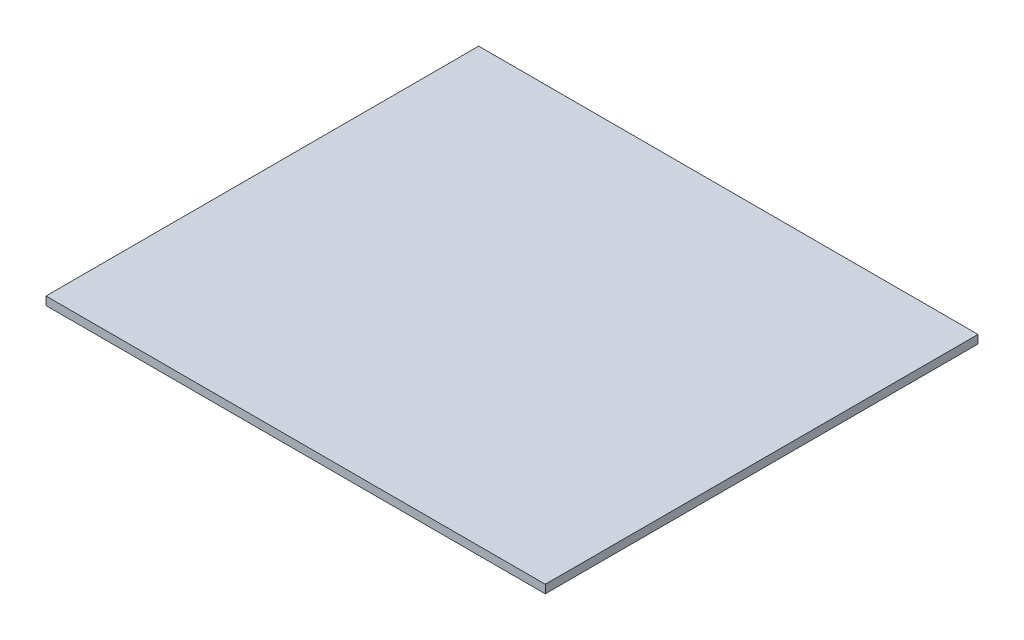
ISO-10303-21;
HEADER;
FILE_DESCRIPTION(('STEP AP214'),'2;1');
FILE_NAME('part.step','',(''),(''),'','','');
FILE_SCHEMA(('AUTOMOTIVE_DESIGN { 1 0 10303 214 1 1 1 1 }'));
ENDSEC;
DATA;
#1=APPLICATION_CONTEXT('core data for automotive mechanical design processes');
#2=APPLICATION_PROTOCOL_DEFINITION('international standard','automotive_design',2000,#1);
#3=PRODUCT_CONTEXT('',#1,'mechanical');
#4=PRODUCT('Part','Part','',(#3));
#5=PRODUCT_RELATED_PRODUCT_CATEGORY('part','',(#4));
#6=PRODUCT_DEFINITION_FORMATION('','',#4);
#7=PRODUCT_DEFINITION_CONTEXT('part definition',#1,'design');
#8=PRODUCT_DEFINITION('design','',#6,#7);
#9=PRODUCT_DEFINITION_SHAPE('','',#8);
#10=(LENGTH_UNIT() NAMED_UNIT(*) SI_UNIT(.MILLI.,.METRE.));
#11=(NAMED_UNIT(*) PLANE_ANGLE_UNIT() SI_UNIT($,.RADIAN.));
#12=(NAMED_UNIT(*) SI_UNIT($,.STERADIAN.) SOLID_ANGLE_UNIT());
#13=UNCERTAINTY_MEASURE_WITH_UNIT(LENGTH_MEASURE(1.E-05),#10,'distance_accuracy_value','');
#14=(GEOMETRIC_REPRESENTATION_CONTEXT(3) GLOBAL_UNCERTAINTY_ASSIGNED_CONTEXT((#13)) GLOBAL_UNIT_ASSIGNED_CONTEXT((#10,
#11,#12)) REPRESENTATION_CONTEXT('',''));
#15=CARTESIAN_POINT('',(0.,0.,0.));
#16=DIRECTION('',(0.,0.,1.));
#17=DIRECTION('',(1.,0.,0.));
#18=AXIS2_PLACEMENT_3D('',#15,#16,#17);
#19=CARTESIAN_POINT('',(-150.,5.,130.));
#20=DIRECTION('',(1.,0.,0.));
#21=DIRECTION('',(0.,0.,-1.));
#22=AXIS2_PLACEMENT_3D('',#19,#20,#21);
#23=PLANE('',#22);
#24=DIRECTION('',(0.,0.,1.));
#25=VECTOR('',#24,1.);
#26=CARTESIAN_POINT('',(-150.,0.,130.));
#27=LINE('',#26,#25);
#28=CARTESIAN_POINT('',(-150.,0.,-130.));
#29=VERTEX_POINT('',#28);
#30=CARTESIAN_POINT('',(-150.,0.,130.));
#31=VERTEX_POINT('',#30);
#32=EDGE_CURVE('E97',#29,#31,#27,.T.);
#33=ORIENTED_EDGE('',*,*,#32,.T.);
#34=DIRECTION('',(0.,-1.,0.));
#35=VECTOR('',#34,1.);
#36=CARTESIAN_POINT('',(-150.,5.,130.));
#37=LINE('',#36,#35);
#38=CARTESIAN_POINT('',(-150.,5.,130.));
#39=VERTEX_POINT('',#38);
#40=EDGE_CURVE('E11',#39,#31,#37,.T.);
#41=ORIENTED_EDGE('',*,*,#40,.F.);
#42=DIRECTION('',(0.,0.,1.));
#43=VECTOR('',#42,1.);
#44=CARTESIAN_POINT('',(-150.,5.,130.));
#45=LINE('',#44,#43);
#46=CARTESIAN_POINT('',(-150.,5.,-130.));
#47=VERTEX_POINT('',#46);
#48=EDGE_CURVE('E85',#47,#39,#45,.T.);
#49=ORIENTED_EDGE('',*,*,#48,.F.);
#50=DIRECTION('',(0.,-1.,0.));
#51=VECTOR('',#50,1.);
#52=CARTESIAN_POINT('',(-150.,5.,-130.));
#53=LINE('',#52,#51);
#54=EDGE_CURVE('E93',#47,#29,#53,.T.);
#55=ORIENTED_EDGE('',*,*,#54,.T.);
#56=EDGE_LOOP('',(#33,#41,#49,#55));
#57=FACE_BOUND('',#56,.T.);
#58=ADVANCED_FACE('F34',(#57),#23,.F.);
#59=CARTESIAN_POINT('',(150.,5.,130.));
#60=DIRECTION('',(0.,0.,-1.));
#61=DIRECTION('',(-1.,0.,0.));
#62=AXIS2_PLACEMENT_3D('',#59,#60,#61);
#63=PLANE('',#62);
#64=DIRECTION('',(1.,0.,0.));
#65=VECTOR('',#64,1.);
#66=CARTESIAN_POINT('',(150.,0.,130.));
#67=LINE('',#66,#65);
#68=CARTESIAN_POINT('',(150.,0.,130.));
#69=VERTEX_POINT('',#68);
#70=EDGE_CURVE('E89',#31,#69,#67,.T.);
#71=ORIENTED_EDGE('',*,*,#70,.T.);
#72=DIRECTION('',(0.,-1.,0.));
#73=VECTOR('',#72,1.);
#74=CARTESIAN_POINT('',(150.,5.,130.));
#75=LINE('',#74,#73);
#76=CARTESIAN_POINT('',(150.,5.,130.));
#77=VERTEX_POINT('',#76);
#78=EDGE_CURVE('E42',#77,#69,#75,.T.);
#79=ORIENTED_EDGE('',*,*,#78,.F.);
#80=DIRECTION('',(1.,0.,0.));
#81=VECTOR('',#80,1.);
#82=CARTESIAN_POINT('',(150.,5.,130.));
#83=LINE('',#82,#81);
#84=EDGE_CURVE('E80',#39,#77,#83,.T.);
#85=ORIENTED_EDGE('',*,*,#84,.F.);
#86=ORIENTED_EDGE('',*,*,#40,.T.);
#87=EDGE_LOOP('',(#71,#79,#85,#86));
#88=FACE_BOUND('',#87,.T.);
#89=ADVANCED_FACE('F88',(#88),#63,.F.);
#90=CARTESIAN_POINT('',(150.,5.,130.));
#91=DIRECTION('',(-1.,0.,0.));
#92=DIRECTION('',(0.,0.,1.));
#93=AXIS2_PLACEMENT_3D('',#90,#91,#92);
#94=PLANE('',#93);
#95=DIRECTION('',(0.,0.,-1.));
#96=VECTOR('',#95,1.);
#97=CARTESIAN_POINT('',(150.,0.,130.));
#98=LINE('',#97,#96);
#99=CARTESIAN_POINT('',(150.,0.,-130.));
#100=VERTEX_POINT('',#99);
#101=EDGE_CURVE('E67',#69,#100,#98,.T.);
#102=ORIENTED_EDGE('',*,*,#101,.T.);
#103=DIRECTION('',(0.,-1.,0.));
#104=VECTOR('',#103,1.);
#105=CARTESIAN_POINT('',(150.,5.,-130.));
#106=LINE('',#105,#104);
#107=CARTESIAN_POINT('',(150.,5.,-130.));
#108=VERTEX_POINT('',#107);
#109=EDGE_CURVE('E90',#108,#100,#106,.T.);
#110=ORIENTED_EDGE('',*,*,#109,.F.);
#111=DIRECTION('',(0.,0.,-1.));
#112=VECTOR('',#111,1.);
#113=CARTESIAN_POINT('',(150.,5.,130.));
#114=LINE('',#113,#112);
#115=EDGE_CURVE('E83',#77,#108,#114,.T.);
#116=ORIENTED_EDGE('',*,*,#115,.F.);
#117=ORIENTED_EDGE('',*,*,#78,.T.);
#118=EDGE_LOOP('',(#102,#110,#116,#117));
#119=FACE_BOUND('',#118,.T.);
#120=ADVANCED_FACE('F91',(#119),#94,.F.);
#121=CARTESIAN_POINT('',(150.,5.,-130.));
#122=DIRECTION('',(0.,0.,1.));
#123=DIRECTION('',(1.,0.,0.));
#124=AXIS2_PLACEMENT_3D('',#121,#122,#123);
#125=PLANE('',#124);
#126=DIRECTION('',(-1.,0.,0.));
#127=VECTOR('',#126,1.);
#128=CARTESIAN_POINT('',(150.,0.,-130.));
#129=LINE('',#128,#127);
#130=EDGE_CURVE('E73',#100,#29,#129,.T.);
#131=ORIENTED_EDGE('',*,*,#130,.T.);
#132=ORIENTED_EDGE('',*,*,#54,.F.);
#133=DIRECTION('',(-1.,0.,0.));
#134=VECTOR('',#133,1.);
#135=CARTESIAN_POINT('',(150.,5.,-130.));
#136=LINE('',#135,#134);
#137=EDGE_CURVE('E50',#108,#47,#136,.T.);
#138=ORIENTED_EDGE('',*,*,#137,.F.);
#139=ORIENTED_EDGE('',*,*,#109,.T.);
#140=EDGE_LOOP('',(#131,#132,#138,#139));
#141=FACE_BOUND('',#140,.T.);
#142=ADVANCED_FACE('F104',(#141),#125,.F.);
#143=CARTESIAN_POINT('',(0.,5.,0.));
#144=DIRECTION('',(0.,1.,0.));
#145=DIRECTION('',(0.,0.,1.));
#146=AXIS2_PLACEMENT_3D('',#143,#144,#145);
#147=PLANE('',#146);
#148=ORIENTED_EDGE('',*,*,#48,.T.);
#149=ORIENTED_EDGE('',*,*,#84,.T.);
#150=ORIENTED_EDGE('',*,*,#115,.T.);
#151=ORIENTED_EDGE('',*,*,#137,.T.);
#152=EDGE_LOOP('',(#148,#149,#150,#151));
#153=FACE_BOUND('',#152,.T.);
#154=ADVANCED_FACE('F81',(#153),#147,.T.);
#155=CARTESIAN_POINT('',(0.,0.,0.));
#156=DIRECTION('',(0.,1.,0.));
#157=DIRECTION('',(0.,0.,1.));
#158=AXIS2_PLACEMENT_3D('',#155,#156,#157);
#159=PLANE('',#158);
#160=ORIENTED_EDGE('',*,*,#32,.F.);
#161=ORIENTED_EDGE('',*,*,#130,.F.);
#162=ORIENTED_EDGE('',*,*,#101,.F.);
#163=ORIENTED_EDGE('',*,*,#70,.F.);
#164=EDGE_LOOP('',(#160,#161,#162,#163));
#165=FACE_BOUND('',#164,.T.);
#166=ADVANCED_FACE('F107',(#165),#159,.F.);
#167=CLOSED_SHELL('',(#58,#89,#120,#142,#154,#166));
#168=MANIFOLD_SOLID_BREP('B2',#167);
#169=ADVANCED_BREP_SHAPE_REPRESENTATION('',(#18,#168),#14);
#170=SHAPE_DEFINITION_REPRESENTATION(#9,#169);
ENDSEC;
END-ISO-10303-21;
